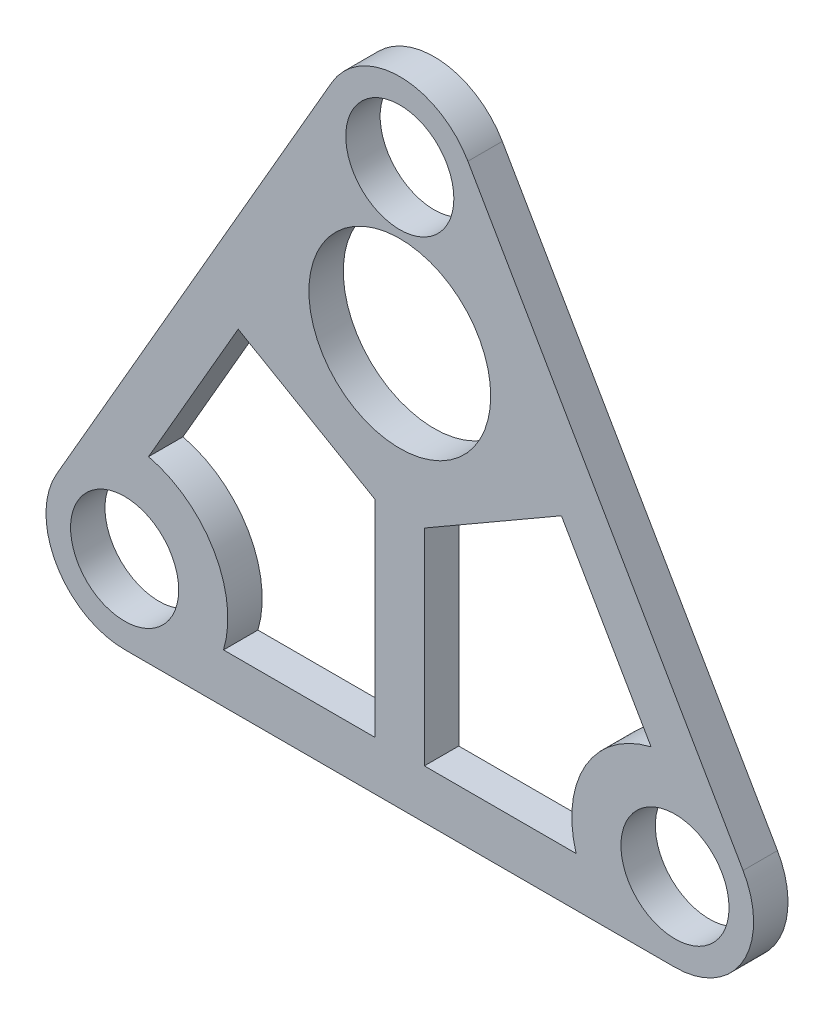
ISO-10303-21;
HEADER;
FILE_DESCRIPTION(('STEP AP214'),'2;1');
FILE_NAME('part.step','',(''),(''),'','','');
FILE_SCHEMA(('AUTOMOTIVE_DESIGN { 1 0 10303 214 1 1 1 1 }'));
ENDSEC;
DATA;
#1=APPLICATION_CONTEXT('core data for automotive mechanical design processes');
#2=APPLICATION_PROTOCOL_DEFINITION('international standard','automotive_design',2000,#1);
#3=PRODUCT_CONTEXT('',#1,'mechanical');
#4=PRODUCT('Part','Part','',(#3));
#5=PRODUCT_RELATED_PRODUCT_CATEGORY('part','',(#4));
#6=PRODUCT_DEFINITION_FORMATION('','',#4);
#7=PRODUCT_DEFINITION_CONTEXT('part definition',#1,'design');
#8=PRODUCT_DEFINITION('design','',#6,#7);
#9=PRODUCT_DEFINITION_SHAPE('','',#8);
#10=(LENGTH_UNIT() NAMED_UNIT(*) SI_UNIT(.MILLI.,.METRE.));
#11=(NAMED_UNIT(*) PLANE_ANGLE_UNIT() SI_UNIT($,.RADIAN.));
#12=(NAMED_UNIT(*) SI_UNIT($,.STERADIAN.) SOLID_ANGLE_UNIT());
#13=UNCERTAINTY_MEASURE_WITH_UNIT(LENGTH_MEASURE(1.E-05),#10,'distance_accuracy_value','');
#14=(GEOMETRIC_REPRESENTATION_CONTEXT(3) GLOBAL_UNCERTAINTY_ASSIGNED_CONTEXT((#13)) GLOBAL_UNIT_ASSIGNED_CONTEXT((#10,
#11,#12)) REPRESENTATION_CONTEXT('',''));
#15=CARTESIAN_POINT('',(0.,0.,0.));
#16=DIRECTION('',(0.,0.,1.));
#17=DIRECTION('',(1.,0.,0.));
#18=AXIS2_PLACEMENT_3D('',#15,#16,#17);
#19=CARTESIAN_POINT('',(56.,96.9948452238571,7.));
#20=DIRECTION('',(0.,0.,1.));
#21=DIRECTION('',(1.,0.,0.));
#22=AXIS2_PLACEMENT_3D('',#19,#20,#21);
#23=PLANE('',#22);
#24=CARTESIAN_POINT('',(56.,65.9448452238571,7.));
#25=DIRECTION('',(0.,0.,1.));
#26=DIRECTION('',(1.,0.,0.));
#27=AXIS2_PLACEMENT_3D('',#24,#25,#26);
#28=CIRCLE('',#27,18.5);
#29=CARTESIAN_POINT('',(74.5,65.9448452238571,7.));
#30=VERTEX_POINT('',#29);
#31=EDGE_CURVE('E178',#30,#30,#28,.T.);
#32=ORIENTED_EDGE('',*,*,#31,.F.);
#33=EDGE_LOOP('',(#32));
#34=FACE_BOUND('',#33,.T.);
#35=CARTESIAN_POINT('',(112.,0.,7.));
#36=DIRECTION('',(0.,0.,1.));
#37=DIRECTION('',(1.,0.,0.));
#38=AXIS2_PLACEMENT_3D('',#35,#36,#37);
#39=CIRCLE('',#38,11.);
#40=CARTESIAN_POINT('',(123.,0.,7.));
#41=VERTEX_POINT('',#40);
#42=EDGE_CURVE('E287',#41,#41,#39,.T.);
#43=ORIENTED_EDGE('',*,*,#42,.F.);
#44=EDGE_LOOP('',(#43));
#45=FACE_BOUND('',#44,.T.);
#46=CARTESIAN_POINT('',(56.,96.9948452238571,7.));
#47=DIRECTION('',(0.,0.,1.));
#48=DIRECTION('',(1.,0.,0.));
#49=AXIS2_PLACEMENT_3D('',#46,#47,#48);
#50=CIRCLE('',#49,16.);
#51=CARTESIAN_POINT('',(69.856406460551,104.994845223857,7.));
#52=VERTEX_POINT('',#51);
#53=CARTESIAN_POINT('',(42.143593539449,104.994845223857,7.));
#54=VERTEX_POINT('',#53);
#55=EDGE_CURVE('E303',#52,#54,#50,.T.);
#56=ORIENTED_EDGE('',*,*,#55,.T.);
#57=DIRECTION('',(-0.5,-0.866025403784439,0.));
#58=VECTOR('',#57,1.);
#59=CARTESIAN_POINT('',(42.143593539449,104.994845223857,7.));
#60=LINE('',#59,#58);
#61=CARTESIAN_POINT('',(-13.856406460551,8.,7.));
#62=VERTEX_POINT('',#61);
#63=EDGE_CURVE('E307',#54,#62,#60,.T.);
#64=ORIENTED_EDGE('',*,*,#63,.T.);
#65=CARTESIAN_POINT('',(0.,0.,7.));
#66=DIRECTION('',(0.,0.,1.));
#67=DIRECTION('',(1.,0.,0.));
#68=AXIS2_PLACEMENT_3D('',#65,#66,#67);
#69=CIRCLE('',#68,16.);
#70=CARTESIAN_POINT('',(0.,-16.,7.));
#71=VERTEX_POINT('',#70);
#72=EDGE_CURVE('E311',#62,#71,#69,.T.);
#73=ORIENTED_EDGE('',*,*,#72,.T.);
#74=DIRECTION('',(1.,0.,0.));
#75=VECTOR('',#74,1.);
#76=CARTESIAN_POINT('',(0.,-16.,7.));
#77=LINE('',#76,#75);
#78=CARTESIAN_POINT('',(112.,-16.,7.));
#79=VERTEX_POINT('',#78);
#80=EDGE_CURVE('E314',#71,#79,#77,.T.);
#81=ORIENTED_EDGE('',*,*,#80,.T.);
#82=CARTESIAN_POINT('',(112.,0.,7.));
#83=DIRECTION('',(0.,0.,1.));
#84=DIRECTION('',(1.,0.,0.));
#85=AXIS2_PLACEMENT_3D('',#82,#83,#84);
#86=CIRCLE('',#85,16.);
#87=CARTESIAN_POINT('',(125.856406460551,8.,7.));
#88=VERTEX_POINT('',#87);
#89=EDGE_CURVE('E317',#79,#88,#86,.T.);
#90=ORIENTED_EDGE('',*,*,#89,.T.);
#91=DIRECTION('',(-0.5,0.866025403784438,0.));
#92=VECTOR('',#91,1.);
#93=CARTESIAN_POINT('',(69.856406460551,104.994845223857,7.));
#94=LINE('',#93,#92);
#95=EDGE_CURVE('E320',#88,#52,#94,.T.);
#96=ORIENTED_EDGE('',*,*,#95,.T.);
#97=EDGE_LOOP('',(#56,#64,#73,#81,#90,#96));
#98=FACE_BOUND('',#97,.T.);
#99=CARTESIAN_POINT('',(0.,0.,7.));
#100=DIRECTION('',(0.,0.,1.));
#101=DIRECTION('',(1.,0.,0.));
#102=AXIS2_PLACEMENT_3D('',#99,#100,#101);
#103=CIRCLE('',#102,11.);
#104=CARTESIAN_POINT('',(11.,0.,7.));
#105=VERTEX_POINT('',#104);
#106=EDGE_CURVE('E295',#105,#105,#103,.T.);
#107=ORIENTED_EDGE('',*,*,#106,.F.);
#108=EDGE_LOOP('',(#107));
#109=FACE_BOUND('',#108,.T.);
#110=CARTESIAN_POINT('',(56.,96.9948452238571,7.));
#111=DIRECTION('',(0.,0.,1.));
#112=DIRECTION('',(1.,0.,0.));
#113=AXIS2_PLACEMENT_3D('',#110,#111,#112);
#114=CIRCLE('',#113,11.);
#115=CARTESIAN_POINT('',(67.,96.9948452238571,7.));
#116=VERTEX_POINT('',#115);
#117=EDGE_CURVE('E279',#116,#116,#114,.T.);
#118=ORIENTED_EDGE('',*,*,#117,.F.);
#119=EDGE_LOOP('',(#118));
#120=FACE_BOUND('',#119,.T.);
#121=DIRECTION('',(-0.5,0.866025403784439,0.));
#122=VECTOR('',#121,1.);
#123=CARTESIAN_POINT('',(88.89119681646,52.0256212160006,7.));
#124=LINE('',#123,#122);
#125=CARTESIAN_POINT('',(107.133846523958,20.4284250579333,7.));
#126=VERTEX_POINT('',#125);
#127=CARTESIAN_POINT('',(88.89119681646,52.0256212160006,7.));
#128=VERTEX_POINT('',#127);
#129=EDGE_CURVE('E224',#126,#128,#124,.T.);
#130=ORIENTED_EDGE('',*,*,#129,.F.);
#131=CARTESIAN_POINT('',(112.,0.,7.));
#132=DIRECTION('',(0.,0.,-1.));
#133=DIRECTION('',(1.,0.,0.));
#134=AXIS2_PLACEMENT_3D('',#131,#132,#133);
#135=CIRCLE('',#134,21.);
#136=CARTESIAN_POINT('',(91.8753882025019,-6.,7.));
#137=VERTEX_POINT('',#136);
#138=EDGE_CURVE('E221',#137,#126,#135,.T.);
#139=ORIENTED_EDGE('',*,*,#138,.F.);
#140=DIRECTION('',(1.,0.,0.));
#141=VECTOR('',#140,1.);
#142=CARTESIAN_POINT('',(61.,-6.00000000000001,7.));
#143=LINE('',#142,#141);
#144=CARTESIAN_POINT('',(61.,-6.,7.));
#145=VERTEX_POINT('',#144);
#146=EDGE_CURVE('E234',#145,#137,#143,.T.);
#147=ORIENTED_EDGE('',*,*,#146,.F.);
#148=DIRECTION('',(0.,-1.,0.));
#149=VECTOR('',#148,1.);
#150=CARTESIAN_POINT('',(61.,35.9226312259966,7.));
#151=LINE('',#150,#149);
#152=CARTESIAN_POINT('',(61.,35.9226312259966,7.));
#153=VERTEX_POINT('',#152);
#154=EDGE_CURVE('E231',#153,#145,#151,.T.);
#155=ORIENTED_EDGE('',*,*,#154,.F.);
#156=DIRECTION('',(-0.866025403784438,-0.500000000000001,0.));
#157=VECTOR('',#156,1.);
#158=CARTESIAN_POINT('',(88.89119681646,52.0256212160006,7.));
#159=LINE('',#158,#157);
#160=EDGE_CURVE('E228',#128,#153,#159,.T.);
#161=ORIENTED_EDGE('',*,*,#160,.F.);
#162=EDGE_LOOP('',(#130,#139,#147,#155,#161));
#163=FACE_BOUND('',#162,.T.);
#164=DIRECTION('',(-0.5,-0.866025403784439,0.));
#165=VECTOR('',#164,1.);
#166=CARTESIAN_POINT('',(23.10880318354,52.0256212160006,7.));
#167=LINE('',#166,#165);
#168=CARTESIAN_POINT('',(23.10880318354,52.0256212160006,7.));
#169=VERTEX_POINT('',#168);
#170=CARTESIAN_POINT('',(4.86615347604242,20.4284250579334,7.));
#171=VERTEX_POINT('',#170);
#172=EDGE_CURVE('E169',#169,#171,#167,.T.);
#173=ORIENTED_EDGE('',*,*,#172,.F.);
#174=DIRECTION('',(-0.866025403784439,0.5,0.));
#175=VECTOR('',#174,1.);
#176=CARTESIAN_POINT('',(23.10880318354,52.0256212160006,7.));
#177=LINE('',#176,#175);
#178=CARTESIAN_POINT('',(51.,35.9226312259966,7.));
#179=VERTEX_POINT('',#178);
#180=EDGE_CURVE('E158',#179,#169,#177,.T.);
#181=ORIENTED_EDGE('',*,*,#180,.F.);
#182=DIRECTION('',(0.,1.,0.));
#183=VECTOR('',#182,1.);
#184=CARTESIAN_POINT('',(51.,35.9226312259966,7.));
#185=LINE('',#184,#183);
#186=CARTESIAN_POINT('',(51.,-6.00000000000001,7.));
#187=VERTEX_POINT('',#186);
#188=EDGE_CURVE('E192',#187,#179,#185,.T.);
#189=ORIENTED_EDGE('',*,*,#188,.F.);
#190=DIRECTION('',(1.,0.,0.));
#191=VECTOR('',#190,1.);
#192=CARTESIAN_POINT('',(20.1246117974981,-6.,7.));
#193=LINE('',#192,#191);
#194=CARTESIAN_POINT('',(20.1246117974981,-6.00000000000001,7.));
#195=VERTEX_POINT('',#194);
#196=EDGE_CURVE('E187',#195,#187,#193,.T.);
#197=ORIENTED_EDGE('',*,*,#196,.F.);
#198=CARTESIAN_POINT('',(0.,0.,7.));
#199=DIRECTION('',(0.,0.,-1.));
#200=DIRECTION('',(1.,0.,0.));
#201=AXIS2_PLACEMENT_3D('',#198,#199,#200);
#202=CIRCLE('',#201,21.);
#203=EDGE_CURVE('E183',#171,#195,#202,.T.);
#204=ORIENTED_EDGE('',*,*,#203,.F.);
#205=EDGE_LOOP('',(#173,#181,#189,#197,#204));
#206=FACE_BOUND('',#205,.T.);
#207=ADVANCED_FACE('F43',(#34,#45,#98,#109,#120,#163,#206),#23,.T.);
#208=CARTESIAN_POINT('',(56.,96.9948452238571,0.));
#209=DIRECTION('',(0.,0.,1.));
#210=DIRECTION('',(1.,0.,0.));
#211=AXIS2_PLACEMENT_3D('',#208,#209,#210);
#212=PLANE('',#211);
#213=CARTESIAN_POINT('',(112.,0.,0.));
#214=DIRECTION('',(0.,0.,-1.));
#215=DIRECTION('',(1.,0.,0.));
#216=AXIS2_PLACEMENT_3D('',#213,#214,#215);
#217=CIRCLE('',#216,21.);
#218=CARTESIAN_POINT('',(91.8753882025019,-6.,0.));
#219=VERTEX_POINT('',#218);
#220=CARTESIAN_POINT('',(107.133846523958,20.4284250579333,0.));
#221=VERTEX_POINT('',#220);
#222=EDGE_CURVE('E238',#219,#221,#217,.T.);
#223=ORIENTED_EDGE('',*,*,#222,.T.);
#224=DIRECTION('',(-0.5,0.866025403784439,0.));
#225=VECTOR('',#224,1.);
#226=CARTESIAN_POINT('',(88.89119681646,52.0256212160006,0.));
#227=LINE('',#226,#225);
#228=CARTESIAN_POINT('',(88.89119681646,52.0256212160006,0.));
#229=VERTEX_POINT('',#228);
#230=EDGE_CURVE('E242',#221,#229,#227,.T.);
#231=ORIENTED_EDGE('',*,*,#230,.T.);
#232=DIRECTION('',(-0.866025403784438,-0.500000000000001,0.));
#233=VECTOR('',#232,1.);
#234=CARTESIAN_POINT('',(88.89119681646,52.0256212160006,0.));
#235=LINE('',#234,#233);
#236=CARTESIAN_POINT('',(61.,35.9226312259966,0.));
#237=VERTEX_POINT('',#236);
#238=EDGE_CURVE('E246',#229,#237,#235,.T.);
#239=ORIENTED_EDGE('',*,*,#238,.T.);
#240=DIRECTION('',(0.,-1.,0.));
#241=VECTOR('',#240,1.);
#242=CARTESIAN_POINT('',(61.,35.9226312259966,0.));
#243=LINE('',#242,#241);
#244=CARTESIAN_POINT('',(61.,-6.00000000000001,0.));
#245=VERTEX_POINT('',#244);
#246=EDGE_CURVE('E250',#237,#245,#243,.T.);
#247=ORIENTED_EDGE('',*,*,#246,.T.);
#248=DIRECTION('',(1.,0.,0.));
#249=VECTOR('',#248,1.);
#250=CARTESIAN_POINT('',(61.,-6.00000000000001,0.));
#251=LINE('',#250,#249);
#252=EDGE_CURVE('E225',#245,#219,#251,.T.);
#253=ORIENTED_EDGE('',*,*,#252,.T.);
#254=EDGE_LOOP('',(#223,#231,#239,#247,#253));
#255=FACE_BOUND('',#254,.T.);
#256=CARTESIAN_POINT('',(56.,65.9448452238571,0.));
#257=DIRECTION('',(0.,0.,1.));
#258=DIRECTION('',(1.,0.,0.));
#259=AXIS2_PLACEMENT_3D('',#256,#257,#258);
#260=CIRCLE('',#259,18.5);
#261=CARTESIAN_POINT('',(74.5,65.9448452238571,0.));
#262=VERTEX_POINT('',#261);
#263=EDGE_CURVE('E271',#262,#262,#260,.T.);
#264=ORIENTED_EDGE('',*,*,#263,.T.);
#265=EDGE_LOOP('',(#264));
#266=FACE_BOUND('',#265,.T.);
#267=CARTESIAN_POINT('',(56.,96.9948452238571,0.));
#268=DIRECTION('',(0.,0.,1.));
#269=DIRECTION('',(1.,0.,0.));
#270=AXIS2_PLACEMENT_3D('',#267,#268,#269);
#271=CIRCLE('',#270,16.);
#272=CARTESIAN_POINT('',(69.856406460551,104.994845223857,0.));
#273=VERTEX_POINT('',#272);
#274=CARTESIAN_POINT('',(42.143593539449,104.994845223857,0.));
#275=VERTEX_POINT('',#274);
#276=EDGE_CURVE('E299',#273,#275,#271,.T.);
#277=ORIENTED_EDGE('',*,*,#276,.F.);
#278=DIRECTION('',(-0.5,0.866025403784438,0.));
#279=VECTOR('',#278,1.);
#280=CARTESIAN_POINT('',(69.856406460551,104.994845223857,0.));
#281=LINE('',#280,#279);
#282=CARTESIAN_POINT('',(125.856406460551,8.,0.));
#283=VERTEX_POINT('',#282);
#284=EDGE_CURVE('E308',#283,#273,#281,.T.);
#285=ORIENTED_EDGE('',*,*,#284,.F.);
#286=CARTESIAN_POINT('',(112.,0.,0.));
#287=DIRECTION('',(0.,0.,1.));
#288=DIRECTION('',(1.,0.,0.));
#289=AXIS2_PLACEMENT_3D('',#286,#287,#288);
#290=CIRCLE('',#289,16.);
#291=CARTESIAN_POINT('',(112.,-16.,0.));
#292=VERTEX_POINT('',#291);
#293=EDGE_CURVE('E336',#292,#283,#290,.T.);
#294=ORIENTED_EDGE('',*,*,#293,.F.);
#295=DIRECTION('',(1.,0.,0.));
#296=VECTOR('',#295,1.);
#297=CARTESIAN_POINT('',(0.,-16.,0.));
#298=LINE('',#297,#296);
#299=CARTESIAN_POINT('',(0.,-16.,0.));
#300=VERTEX_POINT('',#299);
#301=EDGE_CURVE('E333',#300,#292,#298,.T.);
#302=ORIENTED_EDGE('',*,*,#301,.F.);
#303=CARTESIAN_POINT('',(0.,0.,0.));
#304=DIRECTION('',(0.,0.,1.));
#305=DIRECTION('',(1.,0.,0.));
#306=AXIS2_PLACEMENT_3D('',#303,#304,#305);
#307=CIRCLE('',#306,16.);
#308=CARTESIAN_POINT('',(-13.856406460551,8.,0.));
#309=VERTEX_POINT('',#308);
#310=EDGE_CURVE('E330',#309,#300,#307,.T.);
#311=ORIENTED_EDGE('',*,*,#310,.F.);
#312=DIRECTION('',(-0.5,-0.866025403784439,0.));
#313=VECTOR('',#312,1.);
#314=CARTESIAN_POINT('',(42.143593539449,104.994845223857,0.));
#315=LINE('',#314,#313);
#316=EDGE_CURVE('E327',#275,#309,#315,.T.);
#317=ORIENTED_EDGE('',*,*,#316,.F.);
#318=EDGE_LOOP('',(#277,#285,#294,#302,#311,#317));
#319=FACE_BOUND('',#318,.T.);
#320=CARTESIAN_POINT('',(0.,0.,0.));
#321=DIRECTION('',(0.,0.,1.));
#322=DIRECTION('',(1.,0.,0.));
#323=AXIS2_PLACEMENT_3D('',#320,#321,#322);
#324=CIRCLE('',#323,11.);
#325=CARTESIAN_POINT('',(11.,0.,0.));
#326=VERTEX_POINT('',#325);
#327=EDGE_CURVE('E291',#326,#326,#324,.T.);
#328=ORIENTED_EDGE('',*,*,#327,.T.);
#329=EDGE_LOOP('',(#328));
#330=FACE_BOUND('',#329,.T.);
#331=CARTESIAN_POINT('',(112.,0.,0.));
#332=DIRECTION('',(0.,0.,1.));
#333=DIRECTION('',(1.,0.,0.));
#334=AXIS2_PLACEMENT_3D('',#331,#332,#333);
#335=CIRCLE('',#334,11.);
#336=CARTESIAN_POINT('',(123.,0.,0.));
#337=VERTEX_POINT('',#336);
#338=EDGE_CURVE('E283',#337,#337,#335,.T.);
#339=ORIENTED_EDGE('',*,*,#338,.T.);
#340=EDGE_LOOP('',(#339));
#341=FACE_BOUND('',#340,.T.);
#342=CARTESIAN_POINT('',(56.,96.9948452238571,0.));
#343=DIRECTION('',(0.,0.,1.));
#344=DIRECTION('',(1.,0.,0.));
#345=AXIS2_PLACEMENT_3D('',#342,#343,#344);
#346=CIRCLE('',#345,11.);
#347=CARTESIAN_POINT('',(67.,96.9948452238571,0.));
#348=VERTEX_POINT('',#347);
#349=EDGE_CURVE('E275',#348,#348,#346,.T.);
#350=ORIENTED_EDGE('',*,*,#349,.T.);
#351=EDGE_LOOP('',(#350));
#352=FACE_BOUND('',#351,.T.);
#353=DIRECTION('',(-0.866025403784439,0.5,0.));
#354=VECTOR('',#353,1.);
#355=CARTESIAN_POINT('',(23.10880318354,52.0256212160006,0.));
#356=LINE('',#355,#354);
#357=CARTESIAN_POINT('',(51.,35.9226312259966,0.));
#358=VERTEX_POINT('',#357);
#359=CARTESIAN_POINT('',(23.10880318354,52.0256212160006,0.));
#360=VERTEX_POINT('',#359);
#361=EDGE_CURVE('E195',#358,#360,#356,.T.);
#362=ORIENTED_EDGE('',*,*,#361,.T.);
#363=DIRECTION('',(-0.5,-0.866025403784439,0.));
#364=VECTOR('',#363,1.);
#365=CARTESIAN_POINT('',(23.10880318354,52.0256212160006,0.));
#366=LINE('',#365,#364);
#367=CARTESIAN_POINT('',(4.86615347604242,20.4284250579334,0.));
#368=VERTEX_POINT('',#367);
#369=EDGE_CURVE('E176',#360,#368,#366,.T.);
#370=ORIENTED_EDGE('',*,*,#369,.T.);
#371=CARTESIAN_POINT('',(0.,0.,0.));
#372=DIRECTION('',(0.,0.,-1.));
#373=DIRECTION('',(1.,0.,0.));
#374=AXIS2_PLACEMENT_3D('',#371,#372,#373);
#375=CIRCLE('',#374,21.);
#376=CARTESIAN_POINT('',(20.1246117974981,-6.00000000000001,0.));
#377=VERTEX_POINT('',#376);
#378=EDGE_CURVE('E201',#368,#377,#375,.T.);
#379=ORIENTED_EDGE('',*,*,#378,.T.);
#380=DIRECTION('',(1.,0.,0.));
#381=VECTOR('',#380,1.);
#382=CARTESIAN_POINT('',(20.1246117974981,-6.,0.));
#383=LINE('',#382,#381);
#384=CARTESIAN_POINT('',(51.,-6.00000000000001,0.));
#385=VERTEX_POINT('',#384);
#386=EDGE_CURVE('E205',#377,#385,#383,.T.);
#387=ORIENTED_EDGE('',*,*,#386,.T.);
#388=DIRECTION('',(0.,1.,0.));
#389=VECTOR('',#388,1.);
#390=CARTESIAN_POINT('',(51.,35.9226312259966,0.));
#391=LINE('',#390,#389);
#392=EDGE_CURVE('E170',#385,#358,#391,.T.);
#393=ORIENTED_EDGE('',*,*,#392,.T.);
#394=EDGE_LOOP('',(#362,#370,#379,#387,#393));
#395=FACE_BOUND('',#394,.T.);
#396=ADVANCED_FACE('F367',(#255,#266,#319,#330,#341,#352,#395),#212,.F.);
#397=CARTESIAN_POINT('',(56.,96.9948452238571,7.));
#398=DIRECTION('',(0.,0.,-1.));
#399=DIRECTION('',(-1.,0.,0.));
#400=AXIS2_PLACEMENT_3D('',#397,#398,#399);
#401=CYLINDRICAL_SURFACE('',#400,16.);
#402=ORIENTED_EDGE('',*,*,#276,.T.);
#403=DIRECTION('',(0.,0.,-1.));
#404=VECTOR('',#403,1.);
#405=CARTESIAN_POINT('',(42.143593539449,104.994845223857,7.));
#406=LINE('',#405,#404);
#407=EDGE_CURVE('E11',#54,#275,#406,.T.);
#408=ORIENTED_EDGE('',*,*,#407,.F.);
#409=ORIENTED_EDGE('',*,*,#55,.F.);
#410=DIRECTION('',(0.,0.,-1.));
#411=VECTOR('',#410,1.);
#412=CARTESIAN_POINT('',(69.856406460551,104.994845223857,7.));
#413=LINE('',#412,#411);
#414=EDGE_CURVE('E323',#52,#273,#413,.T.);
#415=ORIENTED_EDGE('',*,*,#414,.T.);
#416=EDGE_LOOP('',(#402,#408,#409,#415));
#417=FACE_BOUND('',#416,.T.);
#418=ADVANCED_FACE('F45',(#417),#401,.T.);
#419=CARTESIAN_POINT('',(42.143593539449,104.994845223857,7.));
#420=DIRECTION('',(0.866025403784439,-0.5,0.));
#421=DIRECTION('',(0.5,0.866025403784439,0.));
#422=AXIS2_PLACEMENT_3D('',#419,#420,#421);
#423=PLANE('',#422);
#424=ORIENTED_EDGE('',*,*,#316,.T.);
#425=DIRECTION('',(0.,0.,-1.));
#426=VECTOR('',#425,1.);
#427=CARTESIAN_POINT('',(-13.856406460551,8.,7.));
#428=LINE('',#427,#426);
#429=EDGE_CURVE('E52',#62,#309,#428,.T.);
#430=ORIENTED_EDGE('',*,*,#429,.F.);
#431=ORIENTED_EDGE('',*,*,#63,.F.);
#432=ORIENTED_EDGE('',*,*,#407,.T.);
#433=EDGE_LOOP('',(#424,#430,#431,#432));
#434=FACE_BOUND('',#433,.T.);
#435=ADVANCED_FACE('F385',(#434),#423,.F.);
#436=CARTESIAN_POINT('',(0.,0.,7.));
#437=DIRECTION('',(0.,0.,-1.));
#438=DIRECTION('',(-1.,0.,0.));
#439=AXIS2_PLACEMENT_3D('',#436,#437,#438);
#440=CYLINDRICAL_SURFACE('',#439,16.);
#441=ORIENTED_EDGE('',*,*,#310,.T.);
#442=DIRECTION('',(0.,0.,-1.));
#443=VECTOR('',#442,1.);
#444=CARTESIAN_POINT('',(0.,-16.,7.));
#445=LINE('',#444,#443);
#446=EDGE_CURVE('E352',#71,#300,#445,.T.);
#447=ORIENTED_EDGE('',*,*,#446,.F.);
#448=ORIENTED_EDGE('',*,*,#72,.F.);
#449=ORIENTED_EDGE('',*,*,#429,.T.);
#450=EDGE_LOOP('',(#441,#447,#448,#449));
#451=FACE_BOUND('',#450,.T.);
#452=ADVANCED_FACE('F361',(#451),#440,.T.);
#453=CARTESIAN_POINT('',(0.,-16.,7.));
#454=DIRECTION('',(0.,1.,0.));
#455=DIRECTION('',(0.,0.,1.));
#456=AXIS2_PLACEMENT_3D('',#453,#454,#455);
#457=PLANE('',#456);
#458=ORIENTED_EDGE('',*,*,#301,.T.);
#459=DIRECTION('',(0.,0.,-1.));
#460=VECTOR('',#459,1.);
#461=CARTESIAN_POINT('',(112.,-16.,7.));
#462=LINE('',#461,#460);
#463=EDGE_CURVE('E348',#79,#292,#462,.T.);
#464=ORIENTED_EDGE('',*,*,#463,.F.);
#465=ORIENTED_EDGE('',*,*,#80,.F.);
#466=ORIENTED_EDGE('',*,*,#446,.T.);
#467=EDGE_LOOP('',(#458,#464,#465,#466));
#468=FACE_BOUND('',#467,.T.);
#469=ADVANCED_FACE('F373',(#468),#457,.F.);
#470=CARTESIAN_POINT('',(112.,0.,7.));
#471=DIRECTION('',(0.,0.,-1.));
#472=DIRECTION('',(-1.,0.,0.));
#473=AXIS2_PLACEMENT_3D('',#470,#471,#472);
#474=CYLINDRICAL_SURFACE('',#473,16.);
#475=ORIENTED_EDGE('',*,*,#293,.T.);
#476=DIRECTION('',(0.,0.,-1.));
#477=VECTOR('',#476,1.);
#478=CARTESIAN_POINT('',(125.856406460551,8.,7.));
#479=LINE('',#478,#477);
#480=EDGE_CURVE('E344',#88,#283,#479,.T.);
#481=ORIENTED_EDGE('',*,*,#480,.F.);
#482=ORIENTED_EDGE('',*,*,#89,.F.);
#483=ORIENTED_EDGE('',*,*,#463,.T.);
#484=EDGE_LOOP('',(#475,#481,#482,#483));
#485=FACE_BOUND('',#484,.T.);
#486=ADVANCED_FACE('F377',(#485),#474,.T.);
#487=CARTESIAN_POINT('',(69.856406460551,104.994845223857,7.));
#488=DIRECTION('',(-0.866025403784438,-0.5,0.));
#489=DIRECTION('',(0.5,-0.866025403784439,0.));
#490=AXIS2_PLACEMENT_3D('',#487,#488,#489);
#491=PLANE('',#490);
#492=ORIENTED_EDGE('',*,*,#284,.T.);
#493=ORIENTED_EDGE('',*,*,#414,.F.);
#494=ORIENTED_EDGE('',*,*,#95,.F.);
#495=ORIENTED_EDGE('',*,*,#480,.T.);
#496=EDGE_LOOP('',(#492,#493,#494,#495));
#497=FACE_BOUND('',#496,.T.);
#498=ADVANCED_FACE('F388',(#497),#491,.F.);
#499=CARTESIAN_POINT('',(0.,0.,7.));
#500=DIRECTION('',(0.,0.,-1.));
#501=DIRECTION('',(-1.,0.,0.));
#502=AXIS2_PLACEMENT_3D('',#499,#500,#501);
#503=CYLINDRICAL_SURFACE('',#502,11.);
#504=ORIENTED_EDGE('',*,*,#106,.T.);
#505=EDGE_LOOP('',(#504));
#506=FACE_BOUND('',#505,.T.);
#507=ORIENTED_EDGE('',*,*,#327,.F.);
#508=EDGE_LOOP('',(#507));
#509=FACE_BOUND('',#508,.T.);
#510=ADVANCED_FACE('F390',(#506,#509),#503,.F.);
#511=CARTESIAN_POINT('',(112.,0.,7.));
#512=DIRECTION('',(0.,0.,-1.));
#513=DIRECTION('',(-1.,0.,0.));
#514=AXIS2_PLACEMENT_3D('',#511,#512,#513);
#515=CYLINDRICAL_SURFACE('',#514,11.);
#516=ORIENTED_EDGE('',*,*,#42,.T.);
#517=EDGE_LOOP('',(#516));
#518=FACE_BOUND('',#517,.T.);
#519=ORIENTED_EDGE('',*,*,#338,.F.);
#520=EDGE_LOOP('',(#519));
#521=FACE_BOUND('',#520,.T.);
#522=ADVANCED_FACE('F396',(#518,#521),#515,.F.);
#523=CARTESIAN_POINT('',(56.,96.9948452238571,7.));
#524=DIRECTION('',(0.,0.,-1.));
#525=DIRECTION('',(-1.,0.,0.));
#526=AXIS2_PLACEMENT_3D('',#523,#524,#525);
#527=CYLINDRICAL_SURFACE('',#526,11.);
#528=ORIENTED_EDGE('',*,*,#117,.T.);
#529=EDGE_LOOP('',(#528));
#530=FACE_BOUND('',#529,.T.);
#531=ORIENTED_EDGE('',*,*,#349,.F.);
#532=EDGE_LOOP('',(#531));
#533=FACE_BOUND('',#532,.T.);
#534=ADVANCED_FACE('F413',(#530,#533),#527,.F.);
#535=CARTESIAN_POINT('',(56.,65.9448452238571,0.));
#536=DIRECTION('',(0.,0.,1.));
#537=DIRECTION('',(1.,0.,0.));
#538=AXIS2_PLACEMENT_3D('',#535,#536,#537);
#539=CYLINDRICAL_SURFACE('',#538,18.5);
#540=ORIENTED_EDGE('',*,*,#263,.F.);
#541=EDGE_LOOP('',(#540));
#542=FACE_BOUND('',#541,.T.);
#543=ORIENTED_EDGE('',*,*,#31,.T.);
#544=EDGE_LOOP('',(#543));
#545=FACE_BOUND('',#544,.T.);
#546=ADVANCED_FACE('F417',(#542,#545),#539,.F.);
#547=CARTESIAN_POINT('',(112.,0.,7.));
#548=DIRECTION('',(0.,0.,-1.));
#549=DIRECTION('',(-1.,0.,0.));
#550=AXIS2_PLACEMENT_3D('',#547,#548,#549);
#551=CYLINDRICAL_SURFACE('',#550,21.);
#552=ORIENTED_EDGE('',*,*,#222,.F.);
#553=DIRECTION('',(0.,0.,-1.));
#554=VECTOR('',#553,1.);
#555=CARTESIAN_POINT('',(91.8753882025019,-6.,7.));
#556=LINE('',#555,#554);
#557=EDGE_CURVE('E237',#137,#219,#556,.T.);
#558=ORIENTED_EDGE('',*,*,#557,.F.);
#559=ORIENTED_EDGE('',*,*,#138,.T.);
#560=DIRECTION('',(0.,0.,-1.));
#561=VECTOR('',#560,1.);
#562=CARTESIAN_POINT('',(107.133846523958,20.4284250579333,7.));
#563=LINE('',#562,#561);
#564=EDGE_CURVE('E198',#126,#221,#563,.T.);
#565=ORIENTED_EDGE('',*,*,#564,.T.);
#566=EDGE_LOOP('',(#552,#558,#559,#565));
#567=FACE_BOUND('',#566,.T.);
#568=ADVANCED_FACE('F421',(#567),#551,.T.);
#569=CARTESIAN_POINT('',(88.89119681646,52.0256212160006,7.));
#570=DIRECTION('',(-0.866025403784439,-0.5,0.));
#571=DIRECTION('',(0.5,-0.866025403784439,0.));
#572=AXIS2_PLACEMENT_3D('',#569,#570,#571);
#573=PLANE('',#572);
#574=ORIENTED_EDGE('',*,*,#230,.F.);
#575=ORIENTED_EDGE('',*,*,#564,.F.);
#576=ORIENTED_EDGE('',*,*,#129,.T.);
#577=DIRECTION('',(0.,0.,-1.));
#578=VECTOR('',#577,1.);
#579=CARTESIAN_POINT('',(88.89119681646,52.0256212160006,7.));
#580=LINE('',#579,#578);
#581=EDGE_CURVE('E265',#128,#229,#580,.T.);
#582=ORIENTED_EDGE('',*,*,#581,.T.);
#583=EDGE_LOOP('',(#574,#575,#576,#582));
#584=FACE_BOUND('',#583,.T.);
#585=ADVANCED_FACE('F425',(#584),#573,.T.);
#586=CARTESIAN_POINT('',(88.89119681646,52.0256212160006,7.));
#587=DIRECTION('',(0.500000000000001,-0.866025403784438,0.));
#588=DIRECTION('',(0.866025403784438,0.500000000000001,0.));
#589=AXIS2_PLACEMENT_3D('',#586,#587,#588);
#590=PLANE('',#589);
#591=ORIENTED_EDGE('',*,*,#238,.F.);
#592=ORIENTED_EDGE('',*,*,#581,.F.);
#593=ORIENTED_EDGE('',*,*,#160,.T.);
#594=DIRECTION('',(0.,0.,-1.));
#595=VECTOR('',#594,1.);
#596=CARTESIAN_POINT('',(61.,35.9226312259966,7.));
#597=LINE('',#596,#595);
#598=EDGE_CURVE('E262',#153,#237,#597,.T.);
#599=ORIENTED_EDGE('',*,*,#598,.T.);
#600=EDGE_LOOP('',(#591,#592,#593,#599));
#601=FACE_BOUND('',#600,.T.);
#602=ADVANCED_FACE('F429',(#601),#590,.T.);
#603=CARTESIAN_POINT('',(61.,35.9226312259966,7.));
#604=DIRECTION('',(1.,0.,0.));
#605=DIRECTION('',(0.,1.,0.));
#606=AXIS2_PLACEMENT_3D('',#603,#604,#605);
#607=PLANE('',#606);
#608=ORIENTED_EDGE('',*,*,#246,.F.);
#609=ORIENTED_EDGE('',*,*,#598,.F.);
#610=ORIENTED_EDGE('',*,*,#154,.T.);
#611=DIRECTION('',(0.,0.,-1.));
#612=VECTOR('',#611,1.);
#613=CARTESIAN_POINT('',(61.,-6.00000000000001,7.));
#614=LINE('',#613,#612);
#615=EDGE_CURVE('E67',#145,#245,#614,.T.);
#616=ORIENTED_EDGE('',*,*,#615,.T.);
#617=EDGE_LOOP('',(#608,#609,#610,#616));
#618=FACE_BOUND('',#617,.T.);
#619=ADVANCED_FACE('F433',(#618),#607,.T.);
#620=CARTESIAN_POINT('',(61.,-6.00000000000001,7.));
#621=DIRECTION('',(0.,1.,0.));
#622=DIRECTION('',(-1.,0.,0.));
#623=AXIS2_PLACEMENT_3D('',#620,#621,#622);
#624=PLANE('',#623);
#625=ORIENTED_EDGE('',*,*,#252,.F.);
#626=ORIENTED_EDGE('',*,*,#615,.F.);
#627=ORIENTED_EDGE('',*,*,#146,.T.);
#628=ORIENTED_EDGE('',*,*,#557,.T.);
#629=EDGE_LOOP('',(#625,#626,#627,#628));
#630=FACE_BOUND('',#629,.T.);
#631=ADVANCED_FACE('F437',(#630),#624,.T.);
#632=CARTESIAN_POINT('',(23.10880318354,52.0256212160006,7.));
#633=DIRECTION('',(-0.5,-0.866025403784439,0.));
#634=DIRECTION('',(0.866025403784439,-0.5,0.));
#635=AXIS2_PLACEMENT_3D('',#632,#633,#634);
#636=PLANE('',#635);
#637=ORIENTED_EDGE('',*,*,#361,.F.);
#638=DIRECTION('',(0.,0.,-1.));
#639=VECTOR('',#638,1.);
#640=CARTESIAN_POINT('',(51.,35.9226312259966,7.));
#641=LINE('',#640,#639);
#642=EDGE_CURVE('E164',#179,#358,#641,.T.);
#643=ORIENTED_EDGE('',*,*,#642,.F.);
#644=ORIENTED_EDGE('',*,*,#180,.T.);
#645=DIRECTION('',(0.,0.,-1.));
#646=VECTOR('',#645,1.);
#647=CARTESIAN_POINT('',(23.10880318354,52.0256212160006,7.));
#648=LINE('',#647,#646);
#649=EDGE_CURVE('E161',#169,#360,#648,.T.);
#650=ORIENTED_EDGE('',*,*,#649,.T.);
#651=EDGE_LOOP('',(#637,#643,#644,#650));
#652=FACE_BOUND('',#651,.T.);
#653=ADVANCED_FACE('F160',(#652),#636,.T.);
#654=CARTESIAN_POINT('',(23.10880318354,52.0256212160006,7.));
#655=DIRECTION('',(0.866025403784439,-0.5,0.));
#656=DIRECTION('',(0.5,0.866025403784439,0.));
#657=AXIS2_PLACEMENT_3D('',#654,#655,#656);
#658=PLANE('',#657);
#659=ORIENTED_EDGE('',*,*,#369,.F.);
#660=ORIENTED_EDGE('',*,*,#649,.F.);
#661=ORIENTED_EDGE('',*,*,#172,.T.);
#662=DIRECTION('',(0.,0.,-1.));
#663=VECTOR('',#662,1.);
#664=CARTESIAN_POINT('',(4.86615347604242,20.4284250579334,7.));
#665=LINE('',#664,#663);
#666=EDGE_CURVE('E179',#171,#368,#665,.T.);
#667=ORIENTED_EDGE('',*,*,#666,.T.);
#668=EDGE_LOOP('',(#659,#660,#661,#667));
#669=FACE_BOUND('',#668,.T.);
#670=ADVANCED_FACE('F173',(#669),#658,.T.);
#671=CARTESIAN_POINT('',(0.,0.,7.));
#672=DIRECTION('',(0.,0.,-1.));
#673=DIRECTION('',(-1.,0.,0.));
#674=AXIS2_PLACEMENT_3D('',#671,#672,#673);
#675=CYLINDRICAL_SURFACE('',#674,21.);
#676=ORIENTED_EDGE('',*,*,#378,.F.);
#677=ORIENTED_EDGE('',*,*,#666,.F.);
#678=ORIENTED_EDGE('',*,*,#203,.T.);
#679=DIRECTION('',(0.,0.,-1.));
#680=VECTOR('',#679,1.);
#681=CARTESIAN_POINT('',(20.1246117974981,-6.00000000000001,7.));
#682=LINE('',#681,#680);
#683=EDGE_CURVE('E216',#195,#377,#682,.T.);
#684=ORIENTED_EDGE('',*,*,#683,.T.);
#685=EDGE_LOOP('',(#676,#677,#678,#684));
#686=FACE_BOUND('',#685,.T.);
#687=ADVANCED_FACE('F445',(#686),#675,.T.);
#688=CARTESIAN_POINT('',(20.1246117974981,-6.,7.));
#689=DIRECTION('',(0.,1.,0.));
#690=DIRECTION('',(-1.,0.,0.));
#691=AXIS2_PLACEMENT_3D('',#688,#689,#690);
#692=PLANE('',#691);
#693=ORIENTED_EDGE('',*,*,#386,.F.);
#694=ORIENTED_EDGE('',*,*,#683,.F.);
#695=ORIENTED_EDGE('',*,*,#196,.T.);
#696=DIRECTION('',(0.,0.,-1.));
#697=VECTOR('',#696,1.);
#698=CARTESIAN_POINT('',(51.,-6.00000000000001,7.));
#699=LINE('',#698,#697);
#700=EDGE_CURVE('E59',#187,#385,#699,.T.);
#701=ORIENTED_EDGE('',*,*,#700,.T.);
#702=EDGE_LOOP('',(#693,#694,#695,#701));
#703=FACE_BOUND('',#702,.T.);
#704=ADVANCED_FACE('F448',(#703),#692,.T.);
#705=CARTESIAN_POINT('',(51.,35.9226312259966,7.));
#706=DIRECTION('',(-1.,0.,0.));
#707=DIRECTION('',(0.,-1.,0.));
#708=AXIS2_PLACEMENT_3D('',#705,#706,#707);
#709=PLANE('',#708);
#710=ORIENTED_EDGE('',*,*,#392,.F.);
#711=ORIENTED_EDGE('',*,*,#700,.F.);
#712=ORIENTED_EDGE('',*,*,#188,.T.);
#713=ORIENTED_EDGE('',*,*,#642,.T.);
#714=EDGE_LOOP('',(#710,#711,#712,#713));
#715=FACE_BOUND('',#714,.T.);
#716=ADVANCED_FACE('F452',(#715),#709,.T.);
#717=CLOSED_SHELL('',(#207,#396,#418,#435,#452,#469,#486,#498,#510,#522,#534,#546,#568,#585,
#602,#619,#631,#653,#670,#687,#704,#716));
#718=MANIFOLD_SOLID_BREP('B2',#717);
#719=ADVANCED_BREP_SHAPE_REPRESENTATION('',(#18,#718),#14);
#720=SHAPE_DEFINITION_REPRESENTATION(#9,#719);
ENDSEC;
END-ISO-10303-21;
